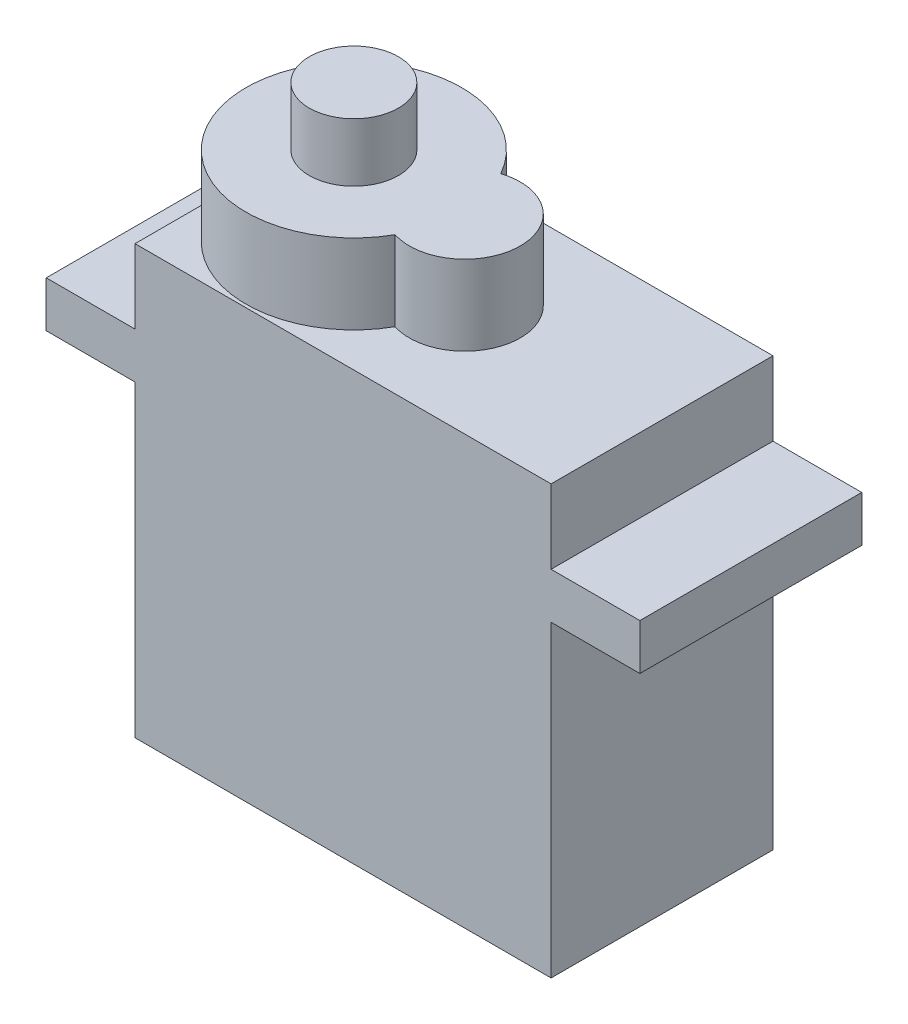
ISO-10303-21;
HEADER;
FILE_DESCRIPTION(('STEP AP214'),'2;1');
FILE_NAME('part.step','',(''),(''),'','','');
FILE_SCHEMA(('AUTOMOTIVE_DESIGN { 1 0 10303 214 1 1 1 1 }'));
ENDSEC;
DATA;
#1=APPLICATION_CONTEXT('core data for automotive mechanical design processes');
#2=APPLICATION_PROTOCOL_DEFINITION('international standard','automotive_design',2000,#1);
#3=PRODUCT_CONTEXT('',#1,'mechanical');
#4=PRODUCT('Part','Part','',(#3));
#5=PRODUCT_RELATED_PRODUCT_CATEGORY('part','',(#4));
#6=PRODUCT_DEFINITION_FORMATION('','',#4);
#7=PRODUCT_DEFINITION_CONTEXT('part definition',#1,'design');
#8=PRODUCT_DEFINITION('design','',#6,#7);
#9=PRODUCT_DEFINITION_SHAPE('','',#8);
#10=(LENGTH_UNIT() NAMED_UNIT(*) SI_UNIT(.MILLI.,.METRE.));
#11=(NAMED_UNIT(*) PLANE_ANGLE_UNIT() SI_UNIT($,.RADIAN.));
#12=(NAMED_UNIT(*) SI_UNIT($,.STERADIAN.) SOLID_ANGLE_UNIT());
#13=UNCERTAINTY_MEASURE_WITH_UNIT(LENGTH_MEASURE(1.E-05),#10,'distance_accuracy_value','');
#14=(GEOMETRIC_REPRESENTATION_CONTEXT(3) GLOBAL_UNCERTAINTY_ASSIGNED_CONTEXT((#13)) GLOBAL_UNIT_ASSIGNED_CONTEXT((#10,
#11,#12)) REPRESENTATION_CONTEXT('',''));
#15=CARTESIAN_POINT('',(0.,0.,0.));
#16=DIRECTION('',(0.,0.,1.));
#17=DIRECTION('',(1.,0.,0.));
#18=AXIS2_PLACEMENT_3D('',#15,#16,#17);
#19=CARTESIAN_POINT('',(0.,16.66,0.));
#20=DIRECTION('',(1.,0.,0.));
#21=DIRECTION('',(0.,0.,-1.));
#22=AXIS2_PLACEMENT_3D('',#19,#20,#21);
#23=PLANE('',#22);
#24=DIRECTION('',(0.,0.,1.));
#25=VECTOR('',#24,1.);
#26=CARTESIAN_POINT('',(0.,0.,0.));
#27=LINE('',#26,#25);
#28=CARTESIAN_POINT('',(0.,0.,-12.));
#29=VERTEX_POINT('',#28);
#30=CARTESIAN_POINT('',(0.,0.,0.));
#31=VERTEX_POINT('',#30);
#32=EDGE_CURVE('E280',#29,#31,#27,.T.);
#33=ORIENTED_EDGE('',*,*,#32,.T.);
#34=DIRECTION('',(0.,-1.,0.));
#35=VECTOR('',#34,1.);
#36=CARTESIAN_POINT('',(0.,16.66,0.));
#37=LINE('',#36,#35);
#38=CARTESIAN_POINT('',(0.,16.66,0.));
#39=VERTEX_POINT('',#38);
#40=EDGE_CURVE('E37',#39,#31,#37,.T.);
#41=ORIENTED_EDGE('',*,*,#40,.F.);
#42=DIRECTION('',(0.,0.,1.));
#43=VECTOR('',#42,1.);
#44=CARTESIAN_POINT('',(0.,16.66,0.));
#45=LINE('',#44,#43);
#46=CARTESIAN_POINT('',(0.,16.66,-12.));
#47=VERTEX_POINT('',#46);
#48=EDGE_CURVE('E281',#47,#39,#45,.T.);
#49=ORIENTED_EDGE('',*,*,#48,.F.);
#50=DIRECTION('',(0.,-1.,0.));
#51=VECTOR('',#50,1.);
#52=CARTESIAN_POINT('',(0.,16.66,-12.));
#53=LINE('',#52,#51);
#54=EDGE_CURVE('E288',#47,#29,#53,.T.);
#55=ORIENTED_EDGE('',*,*,#54,.T.);
#56=EDGE_LOOP('',(#33,#41,#49,#55));
#57=FACE_BOUND('',#56,.T.);
#58=DIRECTION('',(0.,-1.,0.));
#59=VECTOR('',#58,1.);
#60=CARTESIAN_POINT('',(0.,4.1,-7.75));
#61=LINE('',#60,#59);
#62=CARTESIAN_POINT('',(0.,5.3,-7.75));
#63=VERTEX_POINT('',#62);
#64=CARTESIAN_POINT('',(0.,4.1,-7.75));
#65=VERTEX_POINT('',#64);
#66=EDGE_CURVE('E159',#63,#65,#61,.T.);
#67=ORIENTED_EDGE('',*,*,#66,.F.);
#68=DIRECTION('',(0.,0.,-1.));
#69=VECTOR('',#68,1.);
#70=CARTESIAN_POINT('',(0.,5.3,-7.75));
#71=LINE('',#70,#69);
#72=CARTESIAN_POINT('',(0.,5.3,-4.25));
#73=VERTEX_POINT('',#72);
#74=EDGE_CURVE('E161',#73,#63,#71,.T.);
#75=ORIENTED_EDGE('',*,*,#74,.F.);
#76=DIRECTION('',(0.,1.,0.));
#77=VECTOR('',#76,1.);
#78=CARTESIAN_POINT('',(0.,4.1,-4.25));
#79=LINE('',#78,#77);
#80=CARTESIAN_POINT('',(0.,4.1,-4.25));
#81=VERTEX_POINT('',#80);
#82=EDGE_CURVE('E55',#81,#73,#79,.T.);
#83=ORIENTED_EDGE('',*,*,#82,.F.);
#84=DIRECTION('',(0.,0.,1.));
#85=VECTOR('',#84,1.);
#86=CARTESIAN_POINT('',(0.,4.1,-7.75));
#87=LINE('',#86,#85);
#88=EDGE_CURVE('E50',#65,#81,#87,.T.);
#89=ORIENTED_EDGE('',*,*,#88,.F.);
#90=EDGE_LOOP('',(#67,#75,#83,#89));
#91=FACE_BOUND('',#90,.T.);
#92=ADVANCED_FACE('F34',(#57,#91),#23,.F.);
#93=CARTESIAN_POINT('',(0.,19.14,0.));
#94=DIRECTION('',(0.,1.,0.));
#95=DIRECTION('',(0.,0.,1.));
#96=AXIS2_PLACEMENT_3D('',#93,#94,#95);
#97=PLANE('',#96);
#98=DIRECTION('',(0.,0.,1.));
#99=VECTOR('',#98,1.);
#100=CARTESIAN_POINT('',(0.,19.14,-12.));
#101=LINE('',#100,#99);
#102=CARTESIAN_POINT('',(0.,19.14,-12.));
#103=VERTEX_POINT('',#102);
#104=CARTESIAN_POINT('',(0.,19.14,0.));
#105=VERTEX_POINT('',#104);
#106=EDGE_CURVE('E220',#103,#105,#101,.T.);
#107=ORIENTED_EDGE('',*,*,#106,.F.);
#108=DIRECTION('',(-1.,0.,0.));
#109=VECTOR('',#108,1.);
#110=CARTESIAN_POINT('',(-4.8,19.14,-12.));
#111=LINE('',#110,#109);
#112=CARTESIAN_POINT('',(-4.8,19.14,-12.));
#113=VERTEX_POINT('',#112);
#114=EDGE_CURVE('E254',#103,#113,#111,.T.);
#115=ORIENTED_EDGE('',*,*,#114,.T.);
#116=DIRECTION('',(0.,0.,1.));
#117=VECTOR('',#116,1.);
#118=CARTESIAN_POINT('',(-4.8,19.14,-12.));
#119=LINE('',#118,#117);
#120=CARTESIAN_POINT('',(-4.8,19.14,0.));
#121=VERTEX_POINT('',#120);
#122=EDGE_CURVE('E245',#113,#121,#119,.T.);
#123=ORIENTED_EDGE('',*,*,#122,.T.);
#124=DIRECTION('',(1.,0.,0.));
#125=VECTOR('',#124,1.);
#126=CARTESIAN_POINT('',(-4.8,19.14,0.));
#127=LINE('',#126,#125);
#128=EDGE_CURVE('E250',#121,#105,#127,.T.);
#129=ORIENTED_EDGE('',*,*,#128,.T.);
#130=EDGE_LOOP('',(#107,#115,#123,#129));
#131=FACE_BOUND('',#130,.T.);
#132=ADVANCED_FACE('F347',(#131),#97,.T.);
#133=CARTESIAN_POINT('',(0.,16.66,0.));
#134=DIRECTION('',(0.,0.,-1.));
#135=DIRECTION('',(-1.,0.,0.));
#136=AXIS2_PLACEMENT_3D('',#133,#134,#135);
#137=PLANE('',#136);
#138=DIRECTION('',(1.,0.,0.));
#139=VECTOR('',#138,1.);
#140=CARTESIAN_POINT('',(0.,0.,0.));
#141=LINE('',#140,#139);
#142=CARTESIAN_POINT('',(22.5,0.,0.));
#143=VERTEX_POINT('',#142);
#144=EDGE_CURVE('E291',#31,#143,#141,.T.);
#145=ORIENTED_EDGE('',*,*,#144,.T.);
#146=DIRECTION('',(0.,-1.,0.));
#147=VECTOR('',#146,1.);
#148=CARTESIAN_POINT('',(22.5,16.66,0.));
#149=LINE('',#148,#147);
#150=CARTESIAN_POINT('',(22.5,16.66,0.));
#151=VERTEX_POINT('',#150);
#152=EDGE_CURVE('E300',#151,#143,#149,.T.);
#153=ORIENTED_EDGE('',*,*,#152,.F.);
#154=DIRECTION('',(1.,0.,0.));
#155=VECTOR('',#154,1.);
#156=CARTESIAN_POINT('',(-4.8,16.66,0.));
#157=LINE('',#156,#155);
#158=CARTESIAN_POINT('',(27.3,16.66,0.));
#159=VERTEX_POINT('',#158);
#160=EDGE_CURVE('E260',#151,#159,#157,.T.);
#161=ORIENTED_EDGE('',*,*,#160,.T.);
#162=DIRECTION('',(0.,-1.,0.));
#163=VECTOR('',#162,1.);
#164=CARTESIAN_POINT('',(27.3,19.14,0.));
#165=LINE('',#164,#163);
#166=CARTESIAN_POINT('',(27.3,19.14,0.));
#167=VERTEX_POINT('',#166);
#168=EDGE_CURVE('E274',#167,#159,#165,.T.);
#169=ORIENTED_EDGE('',*,*,#168,.F.);
#170=CARTESIAN_POINT('',(22.5,19.14,0.));
#171=VERTEX_POINT('',#170);
#172=EDGE_CURVE('E248',#171,#167,#127,.T.);
#173=ORIENTED_EDGE('',*,*,#172,.F.);
#174=DIRECTION('',(0.,-1.,0.));
#175=VECTOR('',#174,1.);
#176=CARTESIAN_POINT('',(22.5,23.14,0.));
#177=LINE('',#176,#175);
#178=CARTESIAN_POINT('',(22.5,23.14,0.));
#179=VERTEX_POINT('',#178);
#180=EDGE_CURVE('E241',#179,#171,#177,.T.);
#181=ORIENTED_EDGE('',*,*,#180,.F.);
#182=DIRECTION('',(1.,0.,0.));
#183=VECTOR('',#182,1.);
#184=CARTESIAN_POINT('',(0.,23.14,0.));
#185=LINE('',#184,#183);
#186=CARTESIAN_POINT('',(0.,23.14,0.));
#187=VERTEX_POINT('',#186);
#188=EDGE_CURVE('E216',#187,#179,#185,.T.);
#189=ORIENTED_EDGE('',*,*,#188,.F.);
#190=DIRECTION('',(0.,-1.,0.));
#191=VECTOR('',#190,1.);
#192=CARTESIAN_POINT('',(0.,23.14,0.));
#193=LINE('',#192,#191);
#194=EDGE_CURVE('E228',#187,#105,#193,.T.);
#195=ORIENTED_EDGE('',*,*,#194,.T.);
#196=ORIENTED_EDGE('',*,*,#128,.F.);
#197=DIRECTION('',(0.,-1.,0.));
#198=VECTOR('',#197,1.);
#199=CARTESIAN_POINT('',(-4.8,19.14,0.));
#200=LINE('',#199,#198);
#201=CARTESIAN_POINT('',(-4.8,16.66,0.));
#202=VERTEX_POINT('',#201);
#203=EDGE_CURVE('E277',#121,#202,#200,.T.);
#204=ORIENTED_EDGE('',*,*,#203,.T.);
#205=EDGE_CURVE('E261',#202,#39,#157,.T.);
#206=ORIENTED_EDGE('',*,*,#205,.T.);
#207=ORIENTED_EDGE('',*,*,#40,.T.);
#208=EDGE_LOOP('',(#145,#153,#161,#169,#173,#181,#189,#195,#196,#204,#206,#207));
#209=FACE_BOUND('',#208,.T.);
#210=ADVANCED_FACE('F307',(#209),#137,.F.);
#211=CARTESIAN_POINT('',(22.5,16.66,0.));
#212=DIRECTION('',(-1.,0.,0.));
#213=DIRECTION('',(0.,0.,1.));
#214=AXIS2_PLACEMENT_3D('',#211,#212,#213);
#215=PLANE('',#214);
#216=DIRECTION('',(0.,0.,-1.));
#217=VECTOR('',#216,1.);
#218=CARTESIAN_POINT('',(22.5,0.,0.));
#219=LINE('',#218,#217);
#220=CARTESIAN_POINT('',(22.5,0.,-12.));
#221=VERTEX_POINT('',#220);
#222=EDGE_CURVE('E293',#143,#221,#219,.T.);
#223=ORIENTED_EDGE('',*,*,#222,.T.);
#224=DIRECTION('',(0.,-1.,0.));
#225=VECTOR('',#224,1.);
#226=CARTESIAN_POINT('',(22.5,16.66,-12.));
#227=LINE('',#226,#225);
#228=CARTESIAN_POINT('',(22.5,16.66,-12.));
#229=VERTEX_POINT('',#228);
#230=EDGE_CURVE('E298',#229,#221,#227,.T.);
#231=ORIENTED_EDGE('',*,*,#230,.F.);
#232=DIRECTION('',(0.,0.,-1.));
#233=VECTOR('',#232,1.);
#234=CARTESIAN_POINT('',(22.5,16.66,0.));
#235=LINE('',#234,#233);
#236=EDGE_CURVE('E284',#151,#229,#235,.T.);
#237=ORIENTED_EDGE('',*,*,#236,.F.);
#238=ORIENTED_EDGE('',*,*,#152,.T.);
#239=EDGE_LOOP('',(#223,#231,#237,#238));
#240=FACE_BOUND('',#239,.T.);
#241=ADVANCED_FACE('F314',(#240),#215,.F.);
#242=CARTESIAN_POINT('',(0.,16.66,-12.));
#243=DIRECTION('',(0.,0.,1.));
#244=DIRECTION('',(1.,0.,0.));
#245=AXIS2_PLACEMENT_3D('',#242,#243,#244);
#246=PLANE('',#245);
#247=DIRECTION('',(-1.,0.,0.));
#248=VECTOR('',#247,1.);
#249=CARTESIAN_POINT('',(0.,0.,-12.));
#250=LINE('',#249,#248);
#251=EDGE_CURVE('E285',#221,#29,#250,.T.);
#252=ORIENTED_EDGE('',*,*,#251,.T.);
#253=ORIENTED_EDGE('',*,*,#54,.F.);
#254=DIRECTION('',(-1.,0.,0.));
#255=VECTOR('',#254,1.);
#256=CARTESIAN_POINT('',(-4.8,16.66,-12.));
#257=LINE('',#256,#255);
#258=CARTESIAN_POINT('',(-4.8,16.66,-12.));
#259=VERTEX_POINT('',#258);
#260=EDGE_CURVE('E266',#47,#259,#257,.T.);
#261=ORIENTED_EDGE('',*,*,#260,.T.);
#262=DIRECTION('',(0.,-1.,0.));
#263=VECTOR('',#262,1.);
#264=CARTESIAN_POINT('',(-4.8,19.14,-12.));
#265=LINE('',#264,#263);
#266=EDGE_CURVE('E257',#113,#259,#265,.T.);
#267=ORIENTED_EDGE('',*,*,#266,.F.);
#268=ORIENTED_EDGE('',*,*,#114,.F.);
#269=DIRECTION('',(0.,-1.,0.));
#270=VECTOR('',#269,1.);
#271=CARTESIAN_POINT('',(0.,23.14,-12.));
#272=LINE('',#271,#270);
#273=CARTESIAN_POINT('',(0.,23.14,-12.));
#274=VERTEX_POINT('',#273);
#275=EDGE_CURVE('E235',#274,#103,#272,.T.);
#276=ORIENTED_EDGE('',*,*,#275,.F.);
#277=DIRECTION('',(-1.,0.,0.));
#278=VECTOR('',#277,1.);
#279=CARTESIAN_POINT('',(22.5,23.14,-12.));
#280=LINE('',#279,#278);
#281=CARTESIAN_POINT('',(22.5,23.14,-12.));
#282=VERTEX_POINT('',#281);
#283=EDGE_CURVE('E222',#282,#274,#280,.T.);
#284=ORIENTED_EDGE('',*,*,#283,.F.);
#285=DIRECTION('',(0.,-1.,0.));
#286=VECTOR('',#285,1.);
#287=CARTESIAN_POINT('',(22.5,23.14,-12.));
#288=LINE('',#287,#286);
#289=CARTESIAN_POINT('',(22.5,19.14,-12.));
#290=VERTEX_POINT('',#289);
#291=EDGE_CURVE('E238',#282,#290,#288,.T.);
#292=ORIENTED_EDGE('',*,*,#291,.T.);
#293=CARTESIAN_POINT('',(27.3,19.14,-12.));
#294=VERTEX_POINT('',#293);
#295=EDGE_CURVE('E255',#294,#290,#111,.T.);
#296=ORIENTED_EDGE('',*,*,#295,.F.);
#297=DIRECTION('',(0.,-1.,0.));
#298=VECTOR('',#297,1.);
#299=CARTESIAN_POINT('',(27.3,19.14,-12.));
#300=LINE('',#299,#298);
#301=CARTESIAN_POINT('',(27.3,16.66,-12.));
#302=VERTEX_POINT('',#301);
#303=EDGE_CURVE('E271',#294,#302,#300,.T.);
#304=ORIENTED_EDGE('',*,*,#303,.T.);
#305=EDGE_CURVE('E249',#302,#229,#257,.T.);
#306=ORIENTED_EDGE('',*,*,#305,.T.);
#307=ORIENTED_EDGE('',*,*,#230,.T.);
#308=EDGE_LOOP('',(#252,#253,#261,#267,#268,#276,#284,#292,#296,#304,#306,#307));
#309=FACE_BOUND('',#308,.T.);
#310=ADVANCED_FACE('F316',(#309),#246,.F.);
#311=CARTESIAN_POINT('',(0.,0.,0.));
#312=DIRECTION('',(0.,-1.,0.));
#313=DIRECTION('',(0.,0.,-1.));
#314=AXIS2_PLACEMENT_3D('',#311,#312,#313);
#315=PLANE('',#314);
#316=ORIENTED_EDGE('',*,*,#32,.F.);
#317=ORIENTED_EDGE('',*,*,#251,.F.);
#318=ORIENTED_EDGE('',*,*,#222,.F.);
#319=ORIENTED_EDGE('',*,*,#144,.F.);
#320=EDGE_LOOP('',(#316,#317,#318,#319));
#321=FACE_BOUND('',#320,.T.);
#322=ADVANCED_FACE('F313',(#321),#315,.T.);
#323=CARTESIAN_POINT('',(0.,16.66,0.));
#324=DIRECTION('',(0.,1.,0.));
#325=DIRECTION('',(0.,0.,1.));
#326=AXIS2_PLACEMENT_3D('',#323,#324,#325);
#327=PLANE('',#326);
#328=ORIENTED_EDGE('',*,*,#260,.F.);
#329=ORIENTED_EDGE('',*,*,#48,.T.);
#330=ORIENTED_EDGE('',*,*,#205,.F.);
#331=DIRECTION('',(0.,0.,1.));
#332=VECTOR('',#331,1.);
#333=CARTESIAN_POINT('',(-4.8,16.66,-12.));
#334=LINE('',#333,#332);
#335=EDGE_CURVE('E244',#259,#202,#334,.T.);
#336=ORIENTED_EDGE('',*,*,#335,.F.);
#337=EDGE_LOOP('',(#328,#329,#330,#336));
#338=FACE_BOUND('',#337,.T.);
#339=ADVANCED_FACE('F356',(#338),#327,.F.);
#340=ORIENTED_EDGE('',*,*,#160,.F.);
#341=ORIENTED_EDGE('',*,*,#236,.T.);
#342=ORIENTED_EDGE('',*,*,#305,.F.);
#343=DIRECTION('',(0.,0.,-1.));
#344=VECTOR('',#343,1.);
#345=CARTESIAN_POINT('',(27.3,16.66,-12.));
#346=LINE('',#345,#344);
#347=EDGE_CURVE('E264',#159,#302,#346,.T.);
#348=ORIENTED_EDGE('',*,*,#347,.F.);
#349=EDGE_LOOP('',(#340,#341,#342,#348));
#350=FACE_BOUND('',#349,.T.);
#351=ADVANCED_FACE('F323',(#350),#327,.F.);
#352=CARTESIAN_POINT('',(-4.8,19.14,-12.));
#353=DIRECTION('',(1.,0.,0.));
#354=DIRECTION('',(0.,0.,-1.));
#355=AXIS2_PLACEMENT_3D('',#352,#353,#354);
#356=PLANE('',#355);
#357=ORIENTED_EDGE('',*,*,#335,.T.);
#358=ORIENTED_EDGE('',*,*,#203,.F.);
#359=ORIENTED_EDGE('',*,*,#122,.F.);
#360=ORIENTED_EDGE('',*,*,#266,.T.);
#361=EDGE_LOOP('',(#357,#358,#359,#360));
#362=FACE_BOUND('',#361,.T.);
#363=ADVANCED_FACE('F354',(#362),#356,.F.);
#364=CARTESIAN_POINT('',(27.3,19.14,-12.));
#365=DIRECTION('',(-1.,0.,0.));
#366=DIRECTION('',(0.,0.,1.));
#367=AXIS2_PLACEMENT_3D('',#364,#365,#366);
#368=PLANE('',#367);
#369=ORIENTED_EDGE('',*,*,#347,.T.);
#370=ORIENTED_EDGE('',*,*,#303,.F.);
#371=DIRECTION('',(0.,0.,-1.));
#372=VECTOR('',#371,1.);
#373=CARTESIAN_POINT('',(27.3,19.14,-12.));
#374=LINE('',#373,#372);
#375=EDGE_CURVE('E252',#167,#294,#374,.T.);
#376=ORIENTED_EDGE('',*,*,#375,.F.);
#377=ORIENTED_EDGE('',*,*,#168,.T.);
#378=EDGE_LOOP('',(#369,#370,#376,#377));
#379=FACE_BOUND('',#378,.T.);
#380=ADVANCED_FACE('F328',(#379),#368,.F.);
#381=DIRECTION('',(0.,0.,-1.));
#382=VECTOR('',#381,1.);
#383=CARTESIAN_POINT('',(22.5,19.14,0.));
#384=LINE('',#383,#382);
#385=EDGE_CURVE('E215',#171,#290,#384,.T.);
#386=ORIENTED_EDGE('',*,*,#385,.F.);
#387=ORIENTED_EDGE('',*,*,#172,.T.);
#388=ORIENTED_EDGE('',*,*,#375,.T.);
#389=ORIENTED_EDGE('',*,*,#295,.T.);
#390=EDGE_LOOP('',(#386,#387,#388,#389));
#391=FACE_BOUND('',#390,.T.);
#392=ADVANCED_FACE('F330',(#391),#97,.T.);
#393=CARTESIAN_POINT('',(22.5,23.14,0.));
#394=DIRECTION('',(-1.,0.,0.));
#395=DIRECTION('',(0.,0.,1.));
#396=AXIS2_PLACEMENT_3D('',#393,#394,#395);
#397=PLANE('',#396);
#398=ORIENTED_EDGE('',*,*,#385,.T.);
#399=ORIENTED_EDGE('',*,*,#291,.F.);
#400=DIRECTION('',(0.,0.,-1.));
#401=VECTOR('',#400,1.);
#402=CARTESIAN_POINT('',(22.5,23.14,0.));
#403=LINE('',#402,#401);
#404=EDGE_CURVE('E219',#179,#282,#403,.T.);
#405=ORIENTED_EDGE('',*,*,#404,.F.);
#406=ORIENTED_EDGE('',*,*,#180,.T.);
#407=EDGE_LOOP('',(#398,#399,#405,#406));
#408=FACE_BOUND('',#407,.T.);
#409=ADVANCED_FACE('F334',(#408),#397,.F.);
#410=CARTESIAN_POINT('',(0.,23.14,-12.));
#411=DIRECTION('',(1.,0.,0.));
#412=DIRECTION('',(0.,0.,-1.));
#413=AXIS2_PLACEMENT_3D('',#410,#411,#412);
#414=PLANE('',#413);
#415=ORIENTED_EDGE('',*,*,#106,.T.);
#416=ORIENTED_EDGE('',*,*,#194,.F.);
#417=DIRECTION('',(0.,0.,1.));
#418=VECTOR('',#417,1.);
#419=CARTESIAN_POINT('',(0.,23.14,-12.));
#420=LINE('',#419,#418);
#421=CARTESIAN_POINT('',(0.,23.14,-6.));
#422=VERTEX_POINT('',#421);
#423=EDGE_CURVE('E224',#422,#187,#420,.T.);
#424=ORIENTED_EDGE('',*,*,#423,.F.);
#425=EDGE_CURVE('E225',#274,#422,#420,.T.);
#426=ORIENTED_EDGE('',*,*,#425,.F.);
#427=ORIENTED_EDGE('',*,*,#275,.T.);
#428=EDGE_LOOP('',(#415,#416,#424,#426,#427));
#429=FACE_BOUND('',#428,.T.);
#430=ADVANCED_FACE('F342',(#429),#414,.F.);
#431=CARTESIAN_POINT('',(0.,23.14,0.));
#432=DIRECTION('',(0.,1.,0.));
#433=DIRECTION('',(0.,0.,1.));
#434=AXIS2_PLACEMENT_3D('',#431,#432,#433);
#435=PLANE('',#434);
#436=CARTESIAN_POINT('',(11.835,23.14,-6.));
#437=DIRECTION('',(0.,1.,0.));
#438=DIRECTION('',(0.,0.,1.));
#439=AXIS2_PLACEMENT_3D('',#436,#437,#438);
#440=CIRCLE('',#439,3.);
#441=CARTESIAN_POINT('',(10.92226875,23.14,-3.14221735163896));
#442=VERTEX_POINT('',#441);
#443=CARTESIAN_POINT('',(10.92226875,23.14,-8.85778264836104));
#444=VERTEX_POINT('',#443);
#445=EDGE_CURVE('E197',#442,#444,#440,.T.);
#446=ORIENTED_EDGE('',*,*,#445,.F.);
#447=CARTESIAN_POINT('',(5.835,23.14,-6.));
#448=DIRECTION('',(0.,1.,0.));
#449=DIRECTION('',(0.,0.,1.));
#450=AXIS2_PLACEMENT_3D('',#447,#448,#449);
#451=CIRCLE('',#450,5.835);
#452=EDGE_CURVE('E11',#422,#442,#451,.T.);
#453=ORIENTED_EDGE('',*,*,#452,.F.);
#454=ORIENTED_EDGE('',*,*,#423,.T.);
#455=ORIENTED_EDGE('',*,*,#188,.T.);
#456=ORIENTED_EDGE('',*,*,#404,.T.);
#457=ORIENTED_EDGE('',*,*,#283,.T.);
#458=ORIENTED_EDGE('',*,*,#425,.T.);
#459=EDGE_CURVE('E43',#444,#422,#451,.T.);
#460=ORIENTED_EDGE('',*,*,#459,.F.);
#461=EDGE_LOOP('',(#446,#453,#454,#455,#456,#457,#458,#460));
#462=FACE_BOUND('',#461,.T.);
#463=ADVANCED_FACE('F338',(#462),#435,.T.);
#464=CARTESIAN_POINT('',(11.835,27.45,-6.));
#465=DIRECTION('',(0.,-1.,0.));
#466=DIRECTION('',(0.,0.,-1.));
#467=AXIS2_PLACEMENT_3D('',#464,#465,#466);
#468=CYLINDRICAL_SURFACE('',#467,3.);
#469=ORIENTED_EDGE('',*,*,#445,.T.);
#470=DIRECTION('',(0.,-1.,0.));
#471=VECTOR('',#470,1.);
#472=CARTESIAN_POINT('',(10.92226875,27.45,-8.85778264836104));
#473=LINE('',#472,#471);
#474=CARTESIAN_POINT('',(10.92226875,27.45,-8.85778264836104));
#475=VERTEX_POINT('',#474);
#476=EDGE_CURVE('E212',#475,#444,#473,.T.);
#477=ORIENTED_EDGE('',*,*,#476,.F.);
#478=CARTESIAN_POINT('',(11.835,27.45,-6.));
#479=DIRECTION('',(0.,1.,0.));
#480=DIRECTION('',(0.,0.,1.));
#481=AXIS2_PLACEMENT_3D('',#478,#479,#480);
#482=CIRCLE('',#481,3.);
#483=CARTESIAN_POINT('',(10.92226875,27.45,-3.14221735163896));
#484=VERTEX_POINT('',#483);
#485=EDGE_CURVE('E201',#484,#475,#482,.T.);
#486=ORIENTED_EDGE('',*,*,#485,.F.);
#487=DIRECTION('',(0.,-1.,0.));
#488=VECTOR('',#487,1.);
#489=CARTESIAN_POINT('',(10.92226875,27.45,-3.14221735163896));
#490=LINE('',#489,#488);
#491=EDGE_CURVE('E206',#484,#442,#490,.T.);
#492=ORIENTED_EDGE('',*,*,#491,.T.);
#493=EDGE_LOOP('',(#469,#477,#486,#492));
#494=FACE_BOUND('',#493,.T.);
#495=ADVANCED_FACE('F466',(#494),#468,.T.);
#496=CARTESIAN_POINT('',(5.835,27.45,-6.));
#497=DIRECTION('',(0.,-1.,0.));
#498=DIRECTION('',(0.,0.,-1.));
#499=AXIS2_PLACEMENT_3D('',#496,#497,#498);
#500=CYLINDRICAL_SURFACE('',#499,5.835);
#501=ORIENTED_EDGE('',*,*,#459,.T.);
#502=ORIENTED_EDGE('',*,*,#452,.T.);
#503=ORIENTED_EDGE('',*,*,#491,.F.);
#504=CARTESIAN_POINT('',(5.835,27.45,-6.));
#505=DIRECTION('',(0.,1.,0.));
#506=DIRECTION('',(0.,0.,1.));
#507=AXIS2_PLACEMENT_3D('',#504,#505,#506);
#508=CIRCLE('',#507,5.835);
#509=EDGE_CURVE('E204',#475,#484,#508,.T.);
#510=ORIENTED_EDGE('',*,*,#509,.F.);
#511=ORIENTED_EDGE('',*,*,#476,.T.);
#512=EDGE_LOOP('',(#501,#502,#503,#510,#511));
#513=FACE_BOUND('',#512,.T.);
#514=ADVANCED_FACE('F475',(#513),#500,.T.);
#515=CARTESIAN_POINT('',(8.835,27.45,-6.));
#516=DIRECTION('',(0.,1.,0.));
#517=DIRECTION('',(0.,0.,1.));
#518=AXIS2_PLACEMENT_3D('',#515,#516,#517);
#519=PLANE('',#518);
#520=CARTESIAN_POINT('',(5.835,27.45,-6.));
#521=DIRECTION('',(0.,1.,0.));
#522=DIRECTION('',(0.,0.,1.));
#523=AXIS2_PLACEMENT_3D('',#520,#521,#522);
#524=CIRCLE('',#523,2.41);
#525=CARTESIAN_POINT('',(5.835,27.45,-3.59));
#526=VERTEX_POINT('',#525);
#527=EDGE_CURVE('E198',#526,#526,#524,.T.);
#528=ORIENTED_EDGE('',*,*,#527,.F.);
#529=EDGE_LOOP('',(#528));
#530=FACE_BOUND('',#529,.T.);
#531=ORIENTED_EDGE('',*,*,#485,.T.);
#532=ORIENTED_EDGE('',*,*,#509,.T.);
#533=EDGE_LOOP('',(#531,#532));
#534=FACE_BOUND('',#533,.T.);
#535=ADVANCED_FACE('F485',(#530,#534),#519,.T.);
#536=CARTESIAN_POINT('',(5.835,30.61,-6.));
#537=DIRECTION('',(0.,-1.,0.));
#538=DIRECTION('',(0.,0.,-1.));
#539=AXIS2_PLACEMENT_3D('',#536,#537,#538);
#540=CYLINDRICAL_SURFACE('',#539,2.41);
#541=CARTESIAN_POINT('',(5.835,30.61,-6.));
#542=DIRECTION('',(0.,1.,0.));
#543=DIRECTION('',(0.,0.,1.));
#544=AXIS2_PLACEMENT_3D('',#541,#542,#543);
#545=CIRCLE('',#544,2.41);
#546=CARTESIAN_POINT('',(5.835,30.61,-3.59));
#547=VERTEX_POINT('',#546);
#548=EDGE_CURVE('E194',#547,#547,#545,.T.);
#549=ORIENTED_EDGE('',*,*,#548,.F.);
#550=EDGE_LOOP('',(#549));
#551=FACE_BOUND('',#550,.T.);
#552=ORIENTED_EDGE('',*,*,#527,.T.);
#553=EDGE_LOOP('',(#552));
#554=FACE_BOUND('',#553,.T.);
#555=ADVANCED_FACE('F495',(#551,#554),#540,.T.);
#556=CARTESIAN_POINT('',(5.835,30.61,-6.));
#557=DIRECTION('',(0.,1.,0.));
#558=DIRECTION('',(0.,0.,1.));
#559=AXIS2_PLACEMENT_3D('',#556,#557,#558);
#560=PLANE('',#559);
#561=ORIENTED_EDGE('',*,*,#548,.T.);
#562=EDGE_LOOP('',(#561));
#563=FACE_BOUND('',#562,.T.);
#564=ADVANCED_FACE('F505',(#563),#560,.T.);
#565=CARTESIAN_POINT('',(0.,4.1,-7.75));
#566=DIRECTION('',(-0.0523359562429439,0.,-0.998629534754574));
#567=DIRECTION('',(-0.998629534754574,0.,0.052335956242944));
#568=AXIS2_PLACEMENT_3D('',#565,#566,#567);
#569=PLANE('',#568);
#570=ORIENTED_EDGE('',*,*,#66,.T.);
#571=DIRECTION('',(0.997264688634237,-0.052264427688714,-0.052264427688714));
#572=VECTOR('',#571,1.);
#573=CARTESIAN_POINT('',(0.,4.1,-7.75));
#574=LINE('',#573,#572);
#575=CARTESIAN_POINT('',(-3.,4.25722333784912,-7.59277666215088));
#576=VERTEX_POINT('',#575);
#577=EDGE_CURVE('E186',#576,#65,#574,.T.);
#578=ORIENTED_EDGE('',*,*,#577,.F.);
#579=DIRECTION('',(0.,1.,0.));
#580=VECTOR('',#579,1.);
#581=CARTESIAN_POINT('',(-3.,0.,-7.59277666215088));
#582=LINE('',#581,#580);
#583=CARTESIAN_POINT('',(-3.,5.14277666215088,-7.59277666215088));
#584=VERTEX_POINT('',#583);
#585=EDGE_CURVE('E175',#584,#576,#582,.F.);
#586=ORIENTED_EDGE('',*,*,#585,.F.);
#587=DIRECTION('',(0.997264688634237,0.052264427688714,-0.052264427688714));
#588=VECTOR('',#587,1.);
#589=CARTESIAN_POINT('',(-0.0625457618467584,5.29672211551804,-7.74672211551805));
#590=LINE('',#589,#588);
#591=EDGE_CURVE('E171',#584,#63,#590,.T.);
#592=ORIENTED_EDGE('',*,*,#591,.T.);
#593=EDGE_LOOP('',(#570,#578,#586,#592));
#594=FACE_BOUND('',#593,.T.);
#595=ADVANCED_FACE('F177',(#594),#569,.T.);
#596=CARTESIAN_POINT('',(0.,4.1,-7.75));
#597=DIRECTION('',(-0.0523359562429439,-0.998629534754574,0.));
#598=DIRECTION('',(0.998629534754574,-0.052335956242944,0.));
#599=AXIS2_PLACEMENT_3D('',#596,#597,#598);
#600=PLANE('',#599);
#601=ORIENTED_EDGE('',*,*,#88,.T.);
#602=DIRECTION('',(0.997264688634237,-0.052264427688714,0.052264427688714));
#603=VECTOR('',#602,1.);
#604=CARTESIAN_POINT('',(0.,4.1,-4.25));
#605=LINE('',#604,#603);
#606=CARTESIAN_POINT('',(-3.,4.25722333784912,-4.40722333784912));
#607=VERTEX_POINT('',#606);
#608=EDGE_CURVE('E181',#607,#81,#605,.T.);
#609=ORIENTED_EDGE('',*,*,#608,.F.);
#610=DIRECTION('',(0.,0.,-1.));
#611=VECTOR('',#610,1.);
#612=CARTESIAN_POINT('',(-3.,4.25722333784912,0.));
#613=LINE('',#612,#611);
#614=EDGE_CURVE('E191',#576,#607,#613,.F.);
#615=ORIENTED_EDGE('',*,*,#614,.F.);
#616=ORIENTED_EDGE('',*,*,#577,.T.);
#617=EDGE_LOOP('',(#601,#609,#615,#616));
#618=FACE_BOUND('',#617,.T.);
#619=ADVANCED_FACE('F528',(#618),#600,.T.);
#620=CARTESIAN_POINT('',(0.,4.1,-4.25));
#621=DIRECTION('',(-0.0523359562429439,0.,0.998629534754574));
#622=DIRECTION('',(0.998629534754574,0.,0.052335956242944));
#623=AXIS2_PLACEMENT_3D('',#620,#621,#622);
#624=PLANE('',#623);
#625=ORIENTED_EDGE('',*,*,#82,.T.);
#626=DIRECTION('',(0.997264688634237,0.052264427688714,0.052264427688714));
#627=VECTOR('',#626,1.);
#628=CARTESIAN_POINT('',(-0.182425138719712,5.2904395035943,-4.2595604964057));
#629=LINE('',#628,#627);
#630=CARTESIAN_POINT('',(-3.,5.14277666215088,-4.40722333784912));
#631=VERTEX_POINT('',#630);
#632=EDGE_CURVE('E174',#631,#73,#629,.T.);
#633=ORIENTED_EDGE('',*,*,#632,.F.);
#634=DIRECTION('',(0.,-1.,0.));
#635=VECTOR('',#634,1.);
#636=CARTESIAN_POINT('',(-3.,0.,-4.40722333784912));
#637=LINE('',#636,#635);
#638=EDGE_CURVE('E183',#607,#631,#637,.F.);
#639=ORIENTED_EDGE('',*,*,#638,.F.);
#640=ORIENTED_EDGE('',*,*,#608,.T.);
#641=EDGE_LOOP('',(#625,#633,#639,#640));
#642=FACE_BOUND('',#641,.T.);
#643=ADVANCED_FACE('F537',(#642),#624,.T.);
#644=CARTESIAN_POINT('',(0.,5.3,-7.75));
#645=DIRECTION('',(-0.0523359562429439,0.998629534754574,0.));
#646=DIRECTION('',(-0.998629534754574,-0.052335956242944,0.));
#647=AXIS2_PLACEMENT_3D('',#644,#645,#646);
#648=PLANE('',#647);
#649=ORIENTED_EDGE('',*,*,#74,.T.);
#650=ORIENTED_EDGE('',*,*,#591,.F.);
#651=DIRECTION('',(0.,0.,1.));
#652=VECTOR('',#651,1.);
#653=CARTESIAN_POINT('',(-3.,5.14277666215088,0.));
#654=LINE('',#653,#652);
#655=EDGE_CURVE('E179',#631,#584,#654,.F.);
#656=ORIENTED_EDGE('',*,*,#655,.F.);
#657=ORIENTED_EDGE('',*,*,#632,.T.);
#658=EDGE_LOOP('',(#649,#650,#656,#657));
#659=FACE_BOUND('',#658,.T.);
#660=ADVANCED_FACE('F169',(#659),#648,.T.);
#661=CARTESIAN_POINT('',(-3.,0.,0.));
#662=DIRECTION('',(1.,0.,0.));
#663=DIRECTION('',(0.,0.,-1.));
#664=AXIS2_PLACEMENT_3D('',#661,#662,#663);
#665=PLANE('',#664);
#666=ORIENTED_EDGE('',*,*,#585,.T.);
#667=ORIENTED_EDGE('',*,*,#614,.T.);
#668=ORIENTED_EDGE('',*,*,#638,.T.);
#669=ORIENTED_EDGE('',*,*,#655,.T.);
#670=EDGE_LOOP('',(#666,#667,#668,#669));
#671=FACE_BOUND('',#670,.T.);
#672=ADVANCED_FACE('F556',(#671),#665,.F.);
#673=CLOSED_SHELL('',(#92,#132,#210,#241,#310,#322,#339,#351,#363,#380,#392,#409,#430,#463,#495,
#514,#535,#555,#564,#595,#619,#643,#660,#672));
#674=MANIFOLD_SOLID_BREP('B2',#673);
#675=ADVANCED_BREP_SHAPE_REPRESENTATION('',(#18,#674),#14);
#676=SHAPE_DEFINITION_REPRESENTATION(#9,#675);
ENDSEC;
END-ISO-10303-21;
